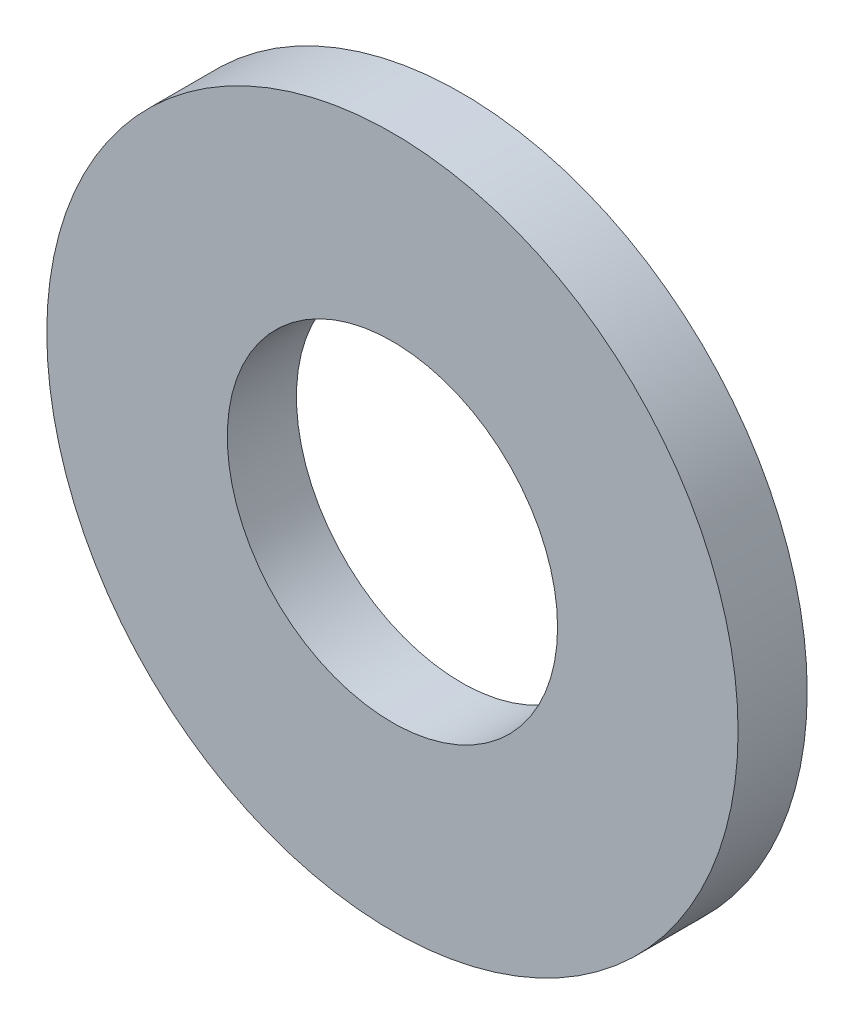
ISO-10303-21;
HEADER;
FILE_DESCRIPTION(('STEP AP214'),'2;1');
FILE_NAME('part.step','',(''),(''),'','','');
FILE_SCHEMA(('AUTOMOTIVE_DESIGN { 1 0 10303 214 1 1 1 1 }'));
ENDSEC;
DATA;
#1=APPLICATION_CONTEXT('core data for automotive mechanical design processes');
#2=APPLICATION_PROTOCOL_DEFINITION('international standard','automotive_design',2000,#1);
#3=PRODUCT_CONTEXT('',#1,'mechanical');
#4=PRODUCT('Part','Part','',(#3));
#5=PRODUCT_RELATED_PRODUCT_CATEGORY('part','',(#4));
#6=PRODUCT_DEFINITION_FORMATION('','',#4);
#7=PRODUCT_DEFINITION_CONTEXT('part definition',#1,'design');
#8=PRODUCT_DEFINITION('design','',#6,#7);
#9=PRODUCT_DEFINITION_SHAPE('','',#8);
#10=(LENGTH_UNIT() NAMED_UNIT(*) SI_UNIT(.MILLI.,.METRE.));
#11=(NAMED_UNIT(*) PLANE_ANGLE_UNIT() SI_UNIT($,.RADIAN.));
#12=(NAMED_UNIT(*) SI_UNIT($,.STERADIAN.) SOLID_ANGLE_UNIT());
#13=UNCERTAINTY_MEASURE_WITH_UNIT(LENGTH_MEASURE(1.E-05),#10,'distance_accuracy_value','');
#14=(GEOMETRIC_REPRESENTATION_CONTEXT(3) GLOBAL_UNCERTAINTY_ASSIGNED_CONTEXT((#13)) GLOBAL_UNIT_ASSIGNED_CONTEXT((#10,
#11,#12)) REPRESENTATION_CONTEXT('',''));
#15=CARTESIAN_POINT('',(0.,0.,0.));
#16=DIRECTION('',(0.,0.,1.));
#17=DIRECTION('',(1.,0.,0.));
#18=AXIS2_PLACEMENT_3D('',#15,#16,#17);
#19=CARTESIAN_POINT('',(0.,0.,0.9));
#20=DIRECTION('',(0.,0.,1.));
#21=DIRECTION('',(1.,0.,0.));
#22=AXIS2_PLACEMENT_3D('',#19,#20,#21);
#23=PLANE('',#22);
#24=CARTESIAN_POINT('',(0.,0.,0.9));
#25=DIRECTION('',(0.,0.,1.));
#26=DIRECTION('',(1.,0.,0.));
#27=AXIS2_PLACEMENT_3D('',#24,#25,#26);
#28=CIRCLE('',#27,4.5);
#29=CARTESIAN_POINT('',(4.5,0.,0.9));
#30=VERTEX_POINT('',#29);
#31=EDGE_CURVE('E10',#30,#30,#28,.T.);
#32=ORIENTED_EDGE('',*,*,#31,.T.);
#33=EDGE_LOOP('',(#32));
#34=FACE_BOUND('',#33,.T.);
#35=CARTESIAN_POINT('',(0.,0.,0.9));
#36=DIRECTION('',(0.,0.,1.));
#37=DIRECTION('',(1.,0.,0.));
#38=AXIS2_PLACEMENT_3D('',#35,#36,#37);
#39=CIRCLE('',#38,2.15);
#40=CARTESIAN_POINT('',(2.15,0.,0.9));
#41=VERTEX_POINT('',#40);
#42=EDGE_CURVE('E46',#41,#41,#39,.T.);
#43=ORIENTED_EDGE('',*,*,#42,.F.);
#44=EDGE_LOOP('',(#43));
#45=FACE_BOUND('',#44,.T.);
#46=ADVANCED_FACE('F35',(#34,#45),#23,.T.);
#47=CARTESIAN_POINT('',(0.,0.,0.));
#48=DIRECTION('',(0.,0.,1.));
#49=DIRECTION('',(1.,0.,0.));
#50=AXIS2_PLACEMENT_3D('',#47,#48,#49);
#51=PLANE('',#50);
#52=CARTESIAN_POINT('',(0.,0.,0.));
#53=DIRECTION('',(0.,0.,1.));
#54=DIRECTION('',(1.,0.,0.));
#55=AXIS2_PLACEMENT_3D('',#52,#53,#54);
#56=CIRCLE('',#55,4.5);
#57=CARTESIAN_POINT('',(4.5,0.,0.));
#58=VERTEX_POINT('',#57);
#59=EDGE_CURVE('E39',#58,#58,#56,.T.);
#60=ORIENTED_EDGE('',*,*,#59,.F.);
#61=EDGE_LOOP('',(#60));
#62=FACE_BOUND('',#61,.T.);
#63=CARTESIAN_POINT('',(0.,0.,0.));
#64=DIRECTION('',(0.,0.,1.));
#65=DIRECTION('',(1.,0.,0.));
#66=AXIS2_PLACEMENT_3D('',#63,#64,#65);
#67=CIRCLE('',#66,2.15);
#68=CARTESIAN_POINT('',(2.15,0.,0.));
#69=VERTEX_POINT('',#68);
#70=EDGE_CURVE('E48',#69,#69,#67,.T.);
#71=ORIENTED_EDGE('',*,*,#70,.T.);
#72=EDGE_LOOP('',(#71));
#73=FACE_BOUND('',#72,.T.);
#74=ADVANCED_FACE('F58',(#62,#73),#51,.F.);
#75=CARTESIAN_POINT('',(0.,0.,0.9));
#76=DIRECTION('',(0.,0.,-1.));
#77=DIRECTION('',(-1.,0.,0.));
#78=AXIS2_PLACEMENT_3D('',#75,#76,#77);
#79=CYLINDRICAL_SURFACE('',#78,4.5);
#80=ORIENTED_EDGE('',*,*,#31,.F.);
#81=EDGE_LOOP('',(#80));
#82=FACE_BOUND('',#81,.T.);
#83=ORIENTED_EDGE('',*,*,#59,.T.);
#84=EDGE_LOOP('',(#83));
#85=FACE_BOUND('',#84,.T.);
#86=ADVANCED_FACE('F37',(#82,#85),#79,.T.);
#87=CARTESIAN_POINT('',(0.,0.,0.9));
#88=DIRECTION('',(0.,0.,-1.));
#89=DIRECTION('',(-1.,0.,0.));
#90=AXIS2_PLACEMENT_3D('',#87,#88,#89);
#91=CYLINDRICAL_SURFACE('',#90,2.15);
#92=ORIENTED_EDGE('',*,*,#42,.T.);
#93=EDGE_LOOP('',(#92));
#94=FACE_BOUND('',#93,.T.);
#95=ORIENTED_EDGE('',*,*,#70,.F.);
#96=EDGE_LOOP('',(#95));
#97=FACE_BOUND('',#96,.T.);
#98=ADVANCED_FACE('F54',(#94,#97),#91,.F.);
#99=CLOSED_SHELL('',(#46,#74,#86,#98));
#100=MANIFOLD_SOLID_BREP('B2',#99);
#101=ADVANCED_BREP_SHAPE_REPRESENTATION('',(#18,#100),#14);
#102=SHAPE_DEFINITION_REPRESENTATION(#9,#101);
ENDSEC;
END-ISO-10303-21;
